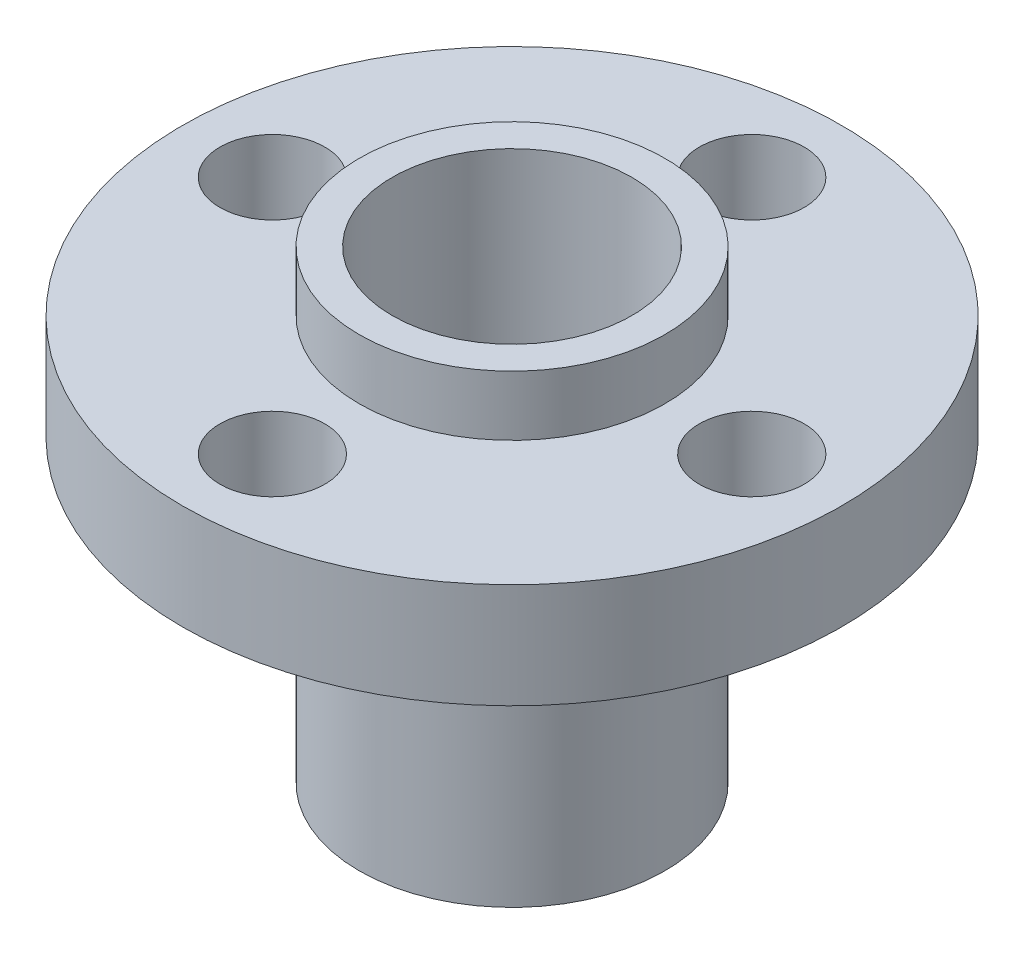
ISO-10303-21;
HEADER;
FILE_DESCRIPTION(('STEP AP214'),'2;1');
FILE_NAME('part.step','',(''),(''),'','','');
FILE_SCHEMA(('AUTOMOTIVE_DESIGN { 1 0 10303 214 1 1 1 1 }'));
ENDSEC;
DATA;
#1=APPLICATION_CONTEXT('core data for automotive mechanical design processes');
#2=APPLICATION_PROTOCOL_DEFINITION('international standard','automotive_design',2000,#1);
#3=PRODUCT_CONTEXT('',#1,'mechanical');
#4=PRODUCT('Part','Part','',(#3));
#5=PRODUCT_RELATED_PRODUCT_CATEGORY('part','',(#4));
#6=PRODUCT_DEFINITION_FORMATION('','',#4);
#7=PRODUCT_DEFINITION_CONTEXT('part definition',#1,'design');
#8=PRODUCT_DEFINITION('design','',#6,#7);
#9=PRODUCT_DEFINITION_SHAPE('','',#8);
#10=(LENGTH_UNIT() NAMED_UNIT(*) SI_UNIT(.MILLI.,.METRE.));
#11=(NAMED_UNIT(*) PLANE_ANGLE_UNIT() SI_UNIT($,.RADIAN.));
#12=(NAMED_UNIT(*) SI_UNIT($,.STERADIAN.) SOLID_ANGLE_UNIT());
#13=UNCERTAINTY_MEASURE_WITH_UNIT(LENGTH_MEASURE(1.E-05),#10,'distance_accuracy_value','');
#14=(GEOMETRIC_REPRESENTATION_CONTEXT(3) GLOBAL_UNCERTAINTY_ASSIGNED_CONTEXT((#13)) GLOBAL_UNIT_ASSIGNED_CONTEXT((#10,
#11,#12)) REPRESENTATION_CONTEXT('',''));
#15=CARTESIAN_POINT('',(0.,0.,0.));
#16=DIRECTION('',(0.,0.,1.));
#17=DIRECTION('',(1.,0.,0.));
#18=AXIS2_PLACEMENT_3D('',#15,#16,#17);
#19=CARTESIAN_POINT('',(0.,10.,0.));
#20=DIRECTION('',(0.,-1.,0.));
#21=DIRECTION('',(0.,0.,-1.));
#22=AXIS2_PLACEMENT_3D('',#19,#20,#21);
#23=CYLINDRICAL_SURFACE('',#22,5.1);
#24=CARTESIAN_POINT('',(0.,10.,0.));
#25=DIRECTION('',(0.,1.,0.));
#26=DIRECTION('',(0.,0.,1.));
#27=AXIS2_PLACEMENT_3D('',#24,#25,#26);
#28=CIRCLE('',#27,5.1);
#29=CARTESIAN_POINT('',(0.,10.,5.1));
#30=VERTEX_POINT('',#29);
#31=EDGE_CURVE('E45',#30,#30,#28,.T.);
#32=ORIENTED_EDGE('',*,*,#31,.F.);
#33=EDGE_LOOP('',(#32));
#34=FACE_BOUND('',#33,.T.);
#35=CARTESIAN_POINT('',(0.,0.,0.));
#36=DIRECTION('',(0.,1.,0.));
#37=DIRECTION('',(0.,0.,1.));
#38=AXIS2_PLACEMENT_3D('',#35,#36,#37);
#39=CIRCLE('',#38,5.1);
#40=CARTESIAN_POINT('',(0.,0.,5.1));
#41=VERTEX_POINT('',#40);
#42=EDGE_CURVE('E51',#41,#41,#39,.T.);
#43=ORIENTED_EDGE('',*,*,#42,.T.);
#44=EDGE_LOOP('',(#43));
#45=FACE_BOUND('',#44,.T.);
#46=ADVANCED_FACE('F37',(#34,#45),#23,.T.);
#47=CARTESIAN_POINT('',(0.,0.,0.));
#48=DIRECTION('',(0.,1.,0.));
#49=DIRECTION('',(0.,0.,1.));
#50=AXIS2_PLACEMENT_3D('',#47,#48,#49);
#51=PLANE('',#50);
#52=CARTESIAN_POINT('',(0.,0.,0.));
#53=DIRECTION('',(0.,1.,0.));
#54=DIRECTION('',(0.,0.,1.));
#55=AXIS2_PLACEMENT_3D('',#52,#53,#54);
#56=CIRCLE('',#55,4.);
#57=CARTESIAN_POINT('',(0.,0.,4.));
#58=VERTEX_POINT('',#57);
#59=EDGE_CURVE('E73',#58,#58,#56,.T.);
#60=ORIENTED_EDGE('',*,*,#59,.T.);
#61=EDGE_LOOP('',(#60));
#62=FACE_BOUND('',#61,.T.);
#63=ORIENTED_EDGE('',*,*,#42,.F.);
#64=EDGE_LOOP('',(#63));
#65=FACE_BOUND('',#64,.T.);
#66=ADVANCED_FACE('F119',(#62,#65),#51,.F.);
#67=CARTESIAN_POINT('',(0.,13.5,0.));
#68=DIRECTION('',(0.,-1.,0.));
#69=DIRECTION('',(0.,0.,-1.));
#70=AXIS2_PLACEMENT_3D('',#67,#68,#69);
#71=CYLINDRICAL_SURFACE('',#70,11.);
#72=CARTESIAN_POINT('',(0.,13.5,0.));
#73=DIRECTION('',(0.,1.,0.));
#74=DIRECTION('',(0.,0.,1.));
#75=AXIS2_PLACEMENT_3D('',#72,#73,#74);
#76=CIRCLE('',#75,11.);
#77=CARTESIAN_POINT('',(0.,13.5,11.));
#78=VERTEX_POINT('',#77);
#79=EDGE_CURVE('E57',#78,#78,#76,.T.);
#80=ORIENTED_EDGE('',*,*,#79,.F.);
#81=EDGE_LOOP('',(#80));
#82=FACE_BOUND('',#81,.T.);
#83=CARTESIAN_POINT('',(0.,10.,0.));
#84=DIRECTION('',(0.,1.,0.));
#85=DIRECTION('',(0.,0.,1.));
#86=AXIS2_PLACEMENT_3D('',#83,#84,#85);
#87=CIRCLE('',#86,11.);
#88=CARTESIAN_POINT('',(0.,10.,11.));
#89=VERTEX_POINT('',#88);
#90=EDGE_CURVE('E61',#89,#89,#87,.T.);
#91=ORIENTED_EDGE('',*,*,#90,.T.);
#92=EDGE_LOOP('',(#91));
#93=FACE_BOUND('',#92,.T.);
#94=ADVANCED_FACE('F124',(#82,#93),#71,.T.);
#95=CARTESIAN_POINT('',(0.,13.5,0.));
#96=DIRECTION('',(0.,1.,0.));
#97=DIRECTION('',(0.,0.,1.));
#98=AXIS2_PLACEMENT_3D('',#95,#96,#97);
#99=PLANE('',#98);
#100=CARTESIAN_POINT('',(-8.,13.5,0.));
#101=DIRECTION('',(0.,1.,0.));
#102=DIRECTION('',(0.,0.,1.));
#103=AXIS2_PLACEMENT_3D('',#100,#101,#102);
#104=CIRCLE('',#103,1.75);
#105=CARTESIAN_POINT('',(-8.,13.5,1.75));
#106=VERTEX_POINT('',#105);
#107=EDGE_CURVE('E94',#106,#106,#104,.T.);
#108=ORIENTED_EDGE('',*,*,#107,.F.);
#109=EDGE_LOOP('',(#108));
#110=FACE_BOUND('',#109,.T.);
#111=CARTESIAN_POINT('',(0.,13.5,8.));
#112=DIRECTION('',(0.,1.,0.));
#113=DIRECTION('',(0.,0.,1.));
#114=AXIS2_PLACEMENT_3D('',#111,#112,#113);
#115=CIRCLE('',#114,1.75);
#116=CARTESIAN_POINT('',(0.,13.5,9.75));
#117=VERTEX_POINT('',#116);
#118=EDGE_CURVE('E81',#117,#117,#115,.T.);
#119=ORIENTED_EDGE('',*,*,#118,.F.);
#120=EDGE_LOOP('',(#119));
#121=FACE_BOUND('',#120,.T.);
#122=CARTESIAN_POINT('',(8.,13.5,0.));
#123=DIRECTION('',(0.,1.,0.));
#124=DIRECTION('',(0.,0.,1.));
#125=AXIS2_PLACEMENT_3D('',#122,#123,#124);
#126=CIRCLE('',#125,1.75);
#127=CARTESIAN_POINT('',(8.,13.5,1.75));
#128=VERTEX_POINT('',#127);
#129=EDGE_CURVE('E77',#128,#128,#126,.T.);
#130=ORIENTED_EDGE('',*,*,#129,.F.);
#131=EDGE_LOOP('',(#130));
#132=FACE_BOUND('',#131,.T.);
#133=CARTESIAN_POINT('',(0.,13.5,-8.));
#134=DIRECTION('',(0.,1.,0.));
#135=DIRECTION('',(0.,0.,1.));
#136=AXIS2_PLACEMENT_3D('',#133,#134,#135);
#137=CIRCLE('',#136,1.75);
#138=CARTESIAN_POINT('',(0.,13.5,-6.25));
#139=VERTEX_POINT('',#138);
#140=EDGE_CURVE('E72',#139,#139,#137,.T.);
#141=ORIENTED_EDGE('',*,*,#140,.F.);
#142=EDGE_LOOP('',(#141));
#143=FACE_BOUND('',#142,.T.);
#144=CARTESIAN_POINT('',(0.,13.5,0.));
#145=DIRECTION('',(0.,1.,0.));
#146=DIRECTION('',(0.,0.,1.));
#147=AXIS2_PLACEMENT_3D('',#144,#145,#146);
#148=CIRCLE('',#147,5.1);
#149=CARTESIAN_POINT('',(0.,13.5,5.1));
#150=VERTEX_POINT('',#149);
#151=EDGE_CURVE('E10',#150,#150,#148,.T.);
#152=ORIENTED_EDGE('',*,*,#151,.F.);
#153=EDGE_LOOP('',(#152));
#154=FACE_BOUND('',#153,.T.);
#155=ORIENTED_EDGE('',*,*,#79,.T.);
#156=EDGE_LOOP('',(#155));
#157=FACE_BOUND('',#156,.T.);
#158=ADVANCED_FACE('F134',(#110,#121,#132,#143,#154,#157),#99,.T.);
#159=CARTESIAN_POINT('',(0.,10.,0.));
#160=DIRECTION('',(0.,1.,0.));
#161=DIRECTION('',(0.,0.,1.));
#162=AXIS2_PLACEMENT_3D('',#159,#160,#161);
#163=PLANE('',#162);
#164=CARTESIAN_POINT('',(-8.,10.,0.));
#165=DIRECTION('',(0.,1.,0.));
#166=DIRECTION('',(0.,0.,1.));
#167=AXIS2_PLACEMENT_3D('',#164,#165,#166);
#168=CIRCLE('',#167,1.75);
#169=CARTESIAN_POINT('',(-8.,10.,1.75));
#170=VERTEX_POINT('',#169);
#171=EDGE_CURVE('E40',#170,#170,#168,.T.);
#172=ORIENTED_EDGE('',*,*,#171,.T.);
#173=EDGE_LOOP('',(#172));
#174=FACE_BOUND('',#173,.T.);
#175=CARTESIAN_POINT('',(0.,10.,8.));
#176=DIRECTION('',(0.,1.,0.));
#177=DIRECTION('',(0.,0.,1.));
#178=AXIS2_PLACEMENT_3D('',#175,#176,#177);
#179=CIRCLE('',#178,1.75);
#180=CARTESIAN_POINT('',(0.,10.,9.75));
#181=VERTEX_POINT('',#180);
#182=EDGE_CURVE('E78',#181,#181,#179,.T.);
#183=ORIENTED_EDGE('',*,*,#182,.T.);
#184=EDGE_LOOP('',(#183));
#185=FACE_BOUND('',#184,.T.);
#186=CARTESIAN_POINT('',(8.,10.,0.));
#187=DIRECTION('',(0.,1.,0.));
#188=DIRECTION('',(0.,0.,1.));
#189=AXIS2_PLACEMENT_3D('',#186,#187,#188);
#190=CIRCLE('',#189,1.75);
#191=CARTESIAN_POINT('',(8.,10.,1.75));
#192=VERTEX_POINT('',#191);
#193=EDGE_CURVE('E74',#192,#192,#190,.T.);
#194=ORIENTED_EDGE('',*,*,#193,.T.);
#195=EDGE_LOOP('',(#194));
#196=FACE_BOUND('',#195,.T.);
#197=CARTESIAN_POINT('',(0.,10.,-8.));
#198=DIRECTION('',(0.,1.,0.));
#199=DIRECTION('',(0.,0.,1.));
#200=AXIS2_PLACEMENT_3D('',#197,#198,#199);
#201=CIRCLE('',#200,1.75);
#202=CARTESIAN_POINT('',(0.,10.,-6.25));
#203=VERTEX_POINT('',#202);
#204=EDGE_CURVE('E68',#203,#203,#201,.T.);
#205=ORIENTED_EDGE('',*,*,#204,.T.);
#206=EDGE_LOOP('',(#205));
#207=FACE_BOUND('',#206,.T.);
#208=ORIENTED_EDGE('',*,*,#31,.T.);
#209=EDGE_LOOP('',(#208));
#210=FACE_BOUND('',#209,.T.);
#211=ORIENTED_EDGE('',*,*,#90,.F.);
#212=EDGE_LOOP('',(#211));
#213=FACE_BOUND('',#212,.T.);
#214=ADVANCED_FACE('F105',(#174,#185,#196,#207,#210,#213),#163,.F.);
#215=CARTESIAN_POINT('',(0.,15.5,0.));
#216=DIRECTION('',(0.,-1.,0.));
#217=DIRECTION('',(0.,0.,-1.));
#218=AXIS2_PLACEMENT_3D('',#215,#216,#217);
#219=CYLINDRICAL_SURFACE('',#218,5.1);
#220=CARTESIAN_POINT('',(0.,15.5,0.));
#221=DIRECTION('',(0.,1.,0.));
#222=DIRECTION('',(0.,0.,1.));
#223=AXIS2_PLACEMENT_3D('',#220,#221,#222);
#224=CIRCLE('',#223,5.1);
#225=CARTESIAN_POINT('',(0.,15.5,5.1));
#226=VERTEX_POINT('',#225);
#227=EDGE_CURVE('E55',#226,#226,#224,.T.);
#228=ORIENTED_EDGE('',*,*,#227,.F.);
#229=EDGE_LOOP('',(#228));
#230=FACE_BOUND('',#229,.T.);
#231=ORIENTED_EDGE('',*,*,#151,.T.);
#232=EDGE_LOOP('',(#231));
#233=FACE_BOUND('',#232,.T.);
#234=ADVANCED_FACE('F133',(#230,#233),#219,.T.);
#235=CARTESIAN_POINT('',(0.,15.5,0.));
#236=DIRECTION('',(0.,1.,0.));
#237=DIRECTION('',(0.,0.,1.));
#238=AXIS2_PLACEMENT_3D('',#235,#236,#237);
#239=PLANE('',#238);
#240=CARTESIAN_POINT('',(0.,15.5,0.));
#241=DIRECTION('',(0.,1.,0.));
#242=DIRECTION('',(0.,0.,1.));
#243=AXIS2_PLACEMENT_3D('',#240,#241,#242);
#244=CIRCLE('',#243,4.);
#245=CARTESIAN_POINT('',(0.,15.5,4.));
#246=VERTEX_POINT('',#245);
#247=EDGE_CURVE('E168',#246,#246,#244,.T.);
#248=ORIENTED_EDGE('',*,*,#247,.F.);
#249=EDGE_LOOP('',(#248));
#250=FACE_BOUND('',#249,.T.);
#251=ORIENTED_EDGE('',*,*,#227,.T.);
#252=EDGE_LOOP('',(#251));
#253=FACE_BOUND('',#252,.T.);
#254=ADVANCED_FACE('F150',(#250,#253),#239,.T.);
#255=CARTESIAN_POINT('',(0.,0.,0.));
#256=DIRECTION('',(0.,1.,0.));
#257=DIRECTION('',(0.,0.,1.));
#258=AXIS2_PLACEMENT_3D('',#255,#256,#257);
#259=CYLINDRICAL_SURFACE('',#258,4.);
#260=ORIENTED_EDGE('',*,*,#59,.F.);
#261=EDGE_LOOP('',(#260));
#262=FACE_BOUND('',#261,.T.);
#263=ORIENTED_EDGE('',*,*,#247,.T.);
#264=EDGE_LOOP('',(#263));
#265=FACE_BOUND('',#264,.T.);
#266=ADVANCED_FACE('F154',(#262,#265),#259,.F.);
#267=CARTESIAN_POINT('',(0.,0.,-8.));
#268=DIRECTION('',(0.,1.,0.));
#269=DIRECTION('',(0.,0.,1.));
#270=AXIS2_PLACEMENT_3D('',#267,#268,#269);
#271=CYLINDRICAL_SURFACE('',#270,1.75);
#272=ORIENTED_EDGE('',*,*,#140,.T.);
#273=EDGE_LOOP('',(#272));
#274=FACE_BOUND('',#273,.T.);
#275=ORIENTED_EDGE('',*,*,#204,.F.);
#276=EDGE_LOOP('',(#275));
#277=FACE_BOUND('',#276,.T.);
#278=ADVANCED_FACE('F157',(#274,#277),#271,.F.);
#279=CARTESIAN_POINT('',(8.,0.,0.));
#280=DIRECTION('',(0.,1.,0.));
#281=DIRECTION('',(0.,0.,1.));
#282=AXIS2_PLACEMENT_3D('',#279,#280,#281);
#283=CYLINDRICAL_SURFACE('',#282,1.75);
#284=ORIENTED_EDGE('',*,*,#129,.T.);
#285=EDGE_LOOP('',(#284));
#286=FACE_BOUND('',#285,.T.);
#287=ORIENTED_EDGE('',*,*,#193,.F.);
#288=EDGE_LOOP('',(#287));
#289=FACE_BOUND('',#288,.T.);
#290=ADVANCED_FACE('F114',(#286,#289),#283,.F.);
#291=CARTESIAN_POINT('',(0.,0.,8.));
#292=DIRECTION('',(0.,1.,0.));
#293=DIRECTION('',(0.,0.,1.));
#294=AXIS2_PLACEMENT_3D('',#291,#292,#293);
#295=CYLINDRICAL_SURFACE('',#294,1.75);
#296=ORIENTED_EDGE('',*,*,#118,.T.);
#297=EDGE_LOOP('',(#296));
#298=FACE_BOUND('',#297,.T.);
#299=ORIENTED_EDGE('',*,*,#182,.F.);
#300=EDGE_LOOP('',(#299));
#301=FACE_BOUND('',#300,.T.);
#302=ADVANCED_FACE('F109',(#298,#301),#295,.F.);
#303=CARTESIAN_POINT('',(-8.,0.,0.));
#304=DIRECTION('',(0.,1.,0.));
#305=DIRECTION('',(0.,0.,1.));
#306=AXIS2_PLACEMENT_3D('',#303,#304,#305);
#307=CYLINDRICAL_SURFACE('',#306,1.75);
#308=ORIENTED_EDGE('',*,*,#107,.T.);
#309=EDGE_LOOP('',(#308));
#310=FACE_BOUND('',#309,.T.);
#311=ORIENTED_EDGE('',*,*,#171,.F.);
#312=EDGE_LOOP('',(#311));
#313=FACE_BOUND('',#312,.T.);
#314=ADVANCED_FACE('F107',(#310,#313),#307,.F.);
#315=CLOSED_SHELL('',(#46,#66,#94,#158,#214,#234,#254,#266,#278,#290,#302,#314));
#316=MANIFOLD_SOLID_BREP('B2',#315);
#317=ADVANCED_BREP_SHAPE_REPRESENTATION('',(#18,#316),#14);
#318=SHAPE_DEFINITION_REPRESENTATION(#9,#317);
ENDSEC;
END-ISO-10303-21;
